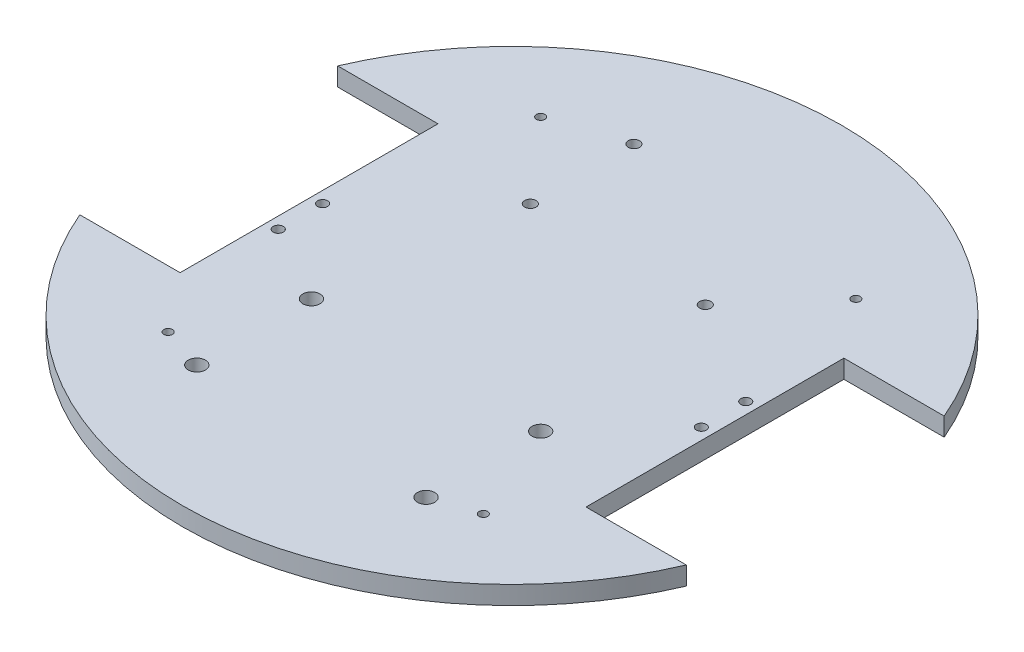
ISO-10303-21;
HEADER;
FILE_DESCRIPTION(('STEP AP214'),'2;1');
FILE_NAME('part.step','',(''),(''),'','','');
FILE_SCHEMA(('AUTOMOTIVE_DESIGN { 1 0 10303 214 1 1 1 1 }'));
ENDSEC;
DATA;
#1=APPLICATION_CONTEXT('core data for automotive mechanical design processes');
#2=APPLICATION_PROTOCOL_DEFINITION('international standard','automotive_design',2000,#1);
#3=PRODUCT_CONTEXT('',#1,'mechanical');
#4=PRODUCT('Part','Part','',(#3));
#5=PRODUCT_RELATED_PRODUCT_CATEGORY('part','',(#4));
#6=PRODUCT_DEFINITION_FORMATION('','',#4);
#7=PRODUCT_DEFINITION_CONTEXT('part definition',#1,'design');
#8=PRODUCT_DEFINITION('design','',#6,#7);
#9=PRODUCT_DEFINITION_SHAPE('','',#8);
#10=(LENGTH_UNIT() NAMED_UNIT(*) SI_UNIT(.MILLI.,.METRE.));
#11=(NAMED_UNIT(*) PLANE_ANGLE_UNIT() SI_UNIT($,.RADIAN.));
#12=(NAMED_UNIT(*) SI_UNIT($,.STERADIAN.) SOLID_ANGLE_UNIT());
#13=UNCERTAINTY_MEASURE_WITH_UNIT(LENGTH_MEASURE(1.E-05),#10,'distance_accuracy_value','');
#14=(GEOMETRIC_REPRESENTATION_CONTEXT(3) GLOBAL_UNCERTAINTY_ASSIGNED_CONTEXT((#13)) GLOBAL_UNIT_ASSIGNED_CONTEXT((#10,
#11,#12)) REPRESENTATION_CONTEXT('',''));
#15=CARTESIAN_POINT('',(0.,0.,0.));
#16=DIRECTION('',(0.,0.,1.));
#17=DIRECTION('',(1.,0.,0.));
#18=AXIS2_PLACEMENT_3D('',#15,#16,#17);
#19=CARTESIAN_POINT('',(0.,6.4,0.));
#20=DIRECTION('',(0.,-1.,0.));
#21=DIRECTION('',(0.,0.,-1.));
#22=AXIS2_PLACEMENT_3D('',#19,#20,#21);
#23=CYLINDRICAL_SURFACE('',#22,115.);
#24=DIRECTION('',(0.,1.,0.));
#25=VECTOR('',#24,1.);
#26=CARTESIAN_POINT('',(105.830052442584,-1.1,45.));
#27=LINE('',#26,#25);
#28=CARTESIAN_POINT('',(105.830052442584,0.,45.));
#29=VERTEX_POINT('',#28);
#30=CARTESIAN_POINT('',(105.830052442584,6.4,45.));
#31=VERTEX_POINT('',#30);
#32=EDGE_CURVE('E106',#29,#31,#27,.T.);
#33=ORIENTED_EDGE('',*,*,#32,.T.);
#34=CARTESIAN_POINT('',(0.,6.4,0.));
#35=DIRECTION('',(0.,1.,0.));
#36=DIRECTION('',(0.,0.,1.));
#37=AXIS2_PLACEMENT_3D('',#34,#35,#36);
#38=CIRCLE('',#37,115.);
#39=CARTESIAN_POINT('',(-105.830052442584,6.4,45.));
#40=VERTEX_POINT('',#39);
#41=EDGE_CURVE('E121',#40,#31,#38,.T.);
#42=ORIENTED_EDGE('',*,*,#41,.F.);
#43=DIRECTION('',(0.,1.,0.));
#44=VECTOR('',#43,1.);
#45=CARTESIAN_POINT('',(-105.830052442584,-1.1,45.));
#46=LINE('',#45,#44);
#47=CARTESIAN_POINT('',(-105.830052442584,0.,45.));
#48=VERTEX_POINT('',#47);
#49=EDGE_CURVE('E167',#48,#40,#46,.T.);
#50=ORIENTED_EDGE('',*,*,#49,.F.);
#51=CARTESIAN_POINT('',(0.,0.,0.));
#52=DIRECTION('',(0.,1.,0.));
#53=DIRECTION('',(0.,0.,1.));
#54=AXIS2_PLACEMENT_3D('',#51,#52,#53);
#55=CIRCLE('',#54,115.);
#56=EDGE_CURVE('E122',#48,#29,#55,.T.);
#57=ORIENTED_EDGE('',*,*,#56,.T.);
#58=EDGE_LOOP('',(#33,#42,#50,#57));
#59=FACE_BOUND('',#58,.T.);
#60=ADVANCED_FACE('F32',(#59),#23,.T.);
#61=CARTESIAN_POINT('',(105.830052442584,6.4,-45.0000000000001));
#62=VERTEX_POINT('',#61);
#63=CARTESIAN_POINT('',(-105.830052442584,6.4,-45.));
#64=VERTEX_POINT('',#63);
#65=EDGE_CURVE('E112',#62,#64,#38,.T.);
#66=ORIENTED_EDGE('',*,*,#65,.F.);
#67=DIRECTION('',(0.,1.,0.));
#68=VECTOR('',#67,1.);
#69=CARTESIAN_POINT('',(105.830052442584,-1.1,-45.0000000000001));
#70=LINE('',#69,#68);
#71=CARTESIAN_POINT('',(105.830052442584,0.,-45.0000000000001));
#72=VERTEX_POINT('',#71);
#73=EDGE_CURVE('E97',#72,#62,#70,.T.);
#74=ORIENTED_EDGE('',*,*,#73,.F.);
#75=CARTESIAN_POINT('',(-105.830052442584,0.,-45.));
#76=VERTEX_POINT('',#75);
#77=EDGE_CURVE('E127',#72,#76,#55,.T.);
#78=ORIENTED_EDGE('',*,*,#77,.T.);
#79=DIRECTION('',(0.,1.,0.));
#80=VECTOR('',#79,1.);
#81=CARTESIAN_POINT('',(-105.830052442584,-1.1,-45.));
#82=LINE('',#81,#80);
#83=EDGE_CURVE('E120',#76,#64,#82,.T.);
#84=ORIENTED_EDGE('',*,*,#83,.T.);
#85=EDGE_LOOP('',(#66,#74,#78,#84));
#86=FACE_BOUND('',#85,.T.);
#87=ADVANCED_FACE('F34',(#86),#23,.T.);
#88=CARTESIAN_POINT('',(0.,6.4,0.));
#89=DIRECTION('',(0.,1.,0.));
#90=DIRECTION('',(0.,0.,1.));
#91=AXIS2_PLACEMENT_3D('',#88,#89,#90);
#92=PLANE('',#91);
#93=CARTESIAN_POINT('',(55.,6.4,-65.));
#94=DIRECTION('',(0.,-1.,0.));
#95=DIRECTION('',(0.,0.,-1.));
#96=AXIS2_PLACEMENT_3D('',#93,#94,#95);
#97=CIRCLE('',#96,1.49999999999999);
#98=CARTESIAN_POINT('',(55.,6.4,-66.5));
#99=VERTEX_POINT('',#98);
#100=EDGE_CURVE('E405',#99,#99,#97,.T.);
#101=ORIENTED_EDGE('',*,*,#100,.T.);
#102=EDGE_LOOP('',(#101));
#103=FACE_BOUND('',#102,.T.);
#104=CARTESIAN_POINT('',(-55.,6.4,-65.));
#105=DIRECTION('',(0.,-1.,0.));
#106=DIRECTION('',(0.,0.,-1.));
#107=AXIS2_PLACEMENT_3D('',#104,#105,#106);
#108=CIRCLE('',#107,1.49999999999999);
#109=CARTESIAN_POINT('',(-55.,6.4,-66.5));
#110=VERTEX_POINT('',#109);
#111=EDGE_CURVE('E415',#110,#110,#108,.T.);
#112=ORIENTED_EDGE('',*,*,#111,.T.);
#113=EDGE_LOOP('',(#112));
#114=FACE_BOUND('',#113,.T.);
#115=CARTESIAN_POINT('',(-55.,6.4,65.));
#116=DIRECTION('',(0.,-1.,0.));
#117=DIRECTION('',(0.,0.,-1.));
#118=AXIS2_PLACEMENT_3D('',#115,#116,#117);
#119=CIRCLE('',#118,1.49999999999999);
#120=CARTESIAN_POINT('',(-55.,6.4,63.5));
#121=VERTEX_POINT('',#120);
#122=EDGE_CURVE('E421',#121,#121,#119,.T.);
#123=ORIENTED_EDGE('',*,*,#122,.T.);
#124=EDGE_LOOP('',(#123));
#125=FACE_BOUND('',#124,.T.);
#126=CARTESIAN_POINT('',(55.,6.4,65.));
#127=DIRECTION('',(0.,-1.,0.));
#128=DIRECTION('',(0.,0.,-1.));
#129=AXIS2_PLACEMENT_3D('',#126,#127,#128);
#130=CIRCLE('',#129,1.49999999999999);
#131=CARTESIAN_POINT('',(55.,6.4,63.5));
#132=VERTEX_POINT('',#131);
#133=EDGE_CURVE('E427',#132,#132,#130,.T.);
#134=ORIENTED_EDGE('',*,*,#133,.T.);
#135=EDGE_LOOP('',(#134));
#136=FACE_BOUND('',#135,.T.);
#137=CARTESIAN_POINT('',(-40.,6.4,69.9999999999988));
#138=DIRECTION('',(0.,1.,0.));
#139=DIRECTION('',(0.,0.,-1.));
#140=AXIS2_PLACEMENT_3D('',#137,#138,#139);
#141=CIRCLE('',#140,3.);
#142=CARTESIAN_POINT('',(-40.,6.4,66.9999999999988));
#143=VERTEX_POINT('',#142);
#144=EDGE_CURVE('E430',#143,#143,#141,.T.);
#145=ORIENTED_EDGE('',*,*,#144,.F.);
#146=EDGE_LOOP('',(#145));
#147=FACE_BOUND('',#146,.T.);
#148=CARTESIAN_POINT('',(40.,6.4,69.9999999999988));
#149=DIRECTION('',(0.,1.,0.));
#150=DIRECTION('',(0.,0.,1.));
#151=AXIS2_PLACEMENT_3D('',#148,#149,#150);
#152=CIRCLE('',#151,3.);
#153=CARTESIAN_POINT('',(40.,6.4,72.9999999999988));
#154=VERTEX_POINT('',#153);
#155=EDGE_CURVE('E434',#154,#154,#152,.T.);
#156=ORIENTED_EDGE('',*,*,#155,.F.);
#157=EDGE_LOOP('',(#156));
#158=FACE_BOUND('',#157,.T.);
#159=CARTESIAN_POINT('',(40.,6.4,30.0000000000011));
#160=DIRECTION('',(0.,1.,0.));
#161=DIRECTION('',(0.,0.,-1.));
#162=AXIS2_PLACEMENT_3D('',#159,#160,#161);
#163=CIRCLE('',#162,3.);
#164=CARTESIAN_POINT('',(40.,6.4,27.0000000000011));
#165=VERTEX_POINT('',#164);
#166=EDGE_CURVE('E440',#165,#165,#163,.T.);
#167=ORIENTED_EDGE('',*,*,#166,.F.);
#168=EDGE_LOOP('',(#167));
#169=FACE_BOUND('',#168,.T.);
#170=CARTESIAN_POINT('',(-40.,6.4,30.0000000000011));
#171=DIRECTION('',(0.,1.,0.));
#172=DIRECTION('',(0.,0.,1.));
#173=AXIS2_PLACEMENT_3D('',#170,#171,#172);
#174=CIRCLE('',#173,3.);
#175=CARTESIAN_POINT('',(-40.,6.4,33.0000000000011));
#176=VERTEX_POINT('',#175);
#177=EDGE_CURVE('E446',#176,#176,#174,.T.);
#178=ORIENTED_EDGE('',*,*,#177,.F.);
#179=EDGE_LOOP('',(#178));
#180=FACE_BOUND('',#179,.T.);
#181=CARTESIAN_POINT('',(-30.525,6.4,-73.07));
#182=DIRECTION('',(0.,1.,0.));
#183=DIRECTION('',(0.,0.,1.));
#184=AXIS2_PLACEMENT_3D('',#181,#182,#183);
#185=CIRCLE('',#184,2.);
#186=CARTESIAN_POINT('',(-30.525,6.4,-71.07));
#187=VERTEX_POINT('',#186);
#188=EDGE_CURVE('E452',#187,#187,#185,.T.);
#189=ORIENTED_EDGE('',*,*,#188,.F.);
#190=EDGE_LOOP('',(#189));
#191=FACE_BOUND('',#190,.T.);
#192=CARTESIAN_POINT('',(-30.525,6.4,-36.93));
#193=DIRECTION('',(0.,1.,0.));
#194=DIRECTION('',(0.,0.,-1.));
#195=AXIS2_PLACEMENT_3D('',#192,#193,#194);
#196=CIRCLE('',#195,2.);
#197=CARTESIAN_POINT('',(-30.525,6.4,-38.93));
#198=VERTEX_POINT('',#197);
#199=EDGE_CURVE('E458',#198,#198,#196,.T.);
#200=ORIENTED_EDGE('',*,*,#199,.F.);
#201=EDGE_LOOP('',(#200));
#202=FACE_BOUND('',#201,.T.);
#203=CARTESIAN_POINT('',(30.525,6.4,-36.93));
#204=DIRECTION('',(0.,1.,0.));
#205=DIRECTION('',(0.,0.,1.));
#206=AXIS2_PLACEMENT_3D('',#203,#204,#205);
#207=CIRCLE('',#206,2.);
#208=CARTESIAN_POINT('',(30.525,6.4,-34.93));
#209=VERTEX_POINT('',#208);
#210=EDGE_CURVE('E464',#209,#209,#207,.T.);
#211=ORIENTED_EDGE('',*,*,#210,.F.);
#212=EDGE_LOOP('',(#211));
#213=FACE_BOUND('',#212,.T.);
#214=CARTESIAN_POINT('',(66.8300524425836,6.4,-14.75));
#215=DIRECTION('',(0.,1.,0.));
#216=DIRECTION('',(0.,0.,-1.));
#217=AXIS2_PLACEMENT_3D('',#214,#215,#216);
#218=CIRCLE('',#217,1.75);
#219=CARTESIAN_POINT('',(66.8300524425836,6.4,-16.5));
#220=VERTEX_POINT('',#219);
#221=EDGE_CURVE('E470',#220,#220,#218,.T.);
#222=ORIENTED_EDGE('',*,*,#221,.F.);
#223=EDGE_LOOP('',(#222));
#224=FACE_BOUND('',#223,.T.);
#225=CARTESIAN_POINT('',(66.8300524425836,6.4,0.749999999999992));
#226=DIRECTION('',(0.,1.,0.));
#227=DIRECTION('',(0.,0.,1.));
#228=AXIS2_PLACEMENT_3D('',#225,#226,#227);
#229=CIRCLE('',#228,1.75);
#230=CARTESIAN_POINT('',(66.8300524425836,6.4,2.49999999999999));
#231=VERTEX_POINT('',#230);
#232=EDGE_CURVE('E476',#231,#231,#229,.T.);
#233=ORIENTED_EDGE('',*,*,#232,.F.);
#234=EDGE_LOOP('',(#233));
#235=FACE_BOUND('',#234,.T.);
#236=CARTESIAN_POINT('',(-66.8300524425836,6.4,14.75));
#237=DIRECTION('',(0.,1.,0.));
#238=DIRECTION('',(0.,0.,-1.));
#239=AXIS2_PLACEMENT_3D('',#236,#237,#238);
#240=CIRCLE('',#239,1.75);
#241=CARTESIAN_POINT('',(-66.8300524425836,6.4,13.));
#242=VERTEX_POINT('',#241);
#243=EDGE_CURVE('E482',#242,#242,#240,.T.);
#244=ORIENTED_EDGE('',*,*,#243,.F.);
#245=EDGE_LOOP('',(#244));
#246=FACE_BOUND('',#245,.T.);
#247=CARTESIAN_POINT('',(-66.8300524425836,6.4,-0.749999999999992));
#248=DIRECTION('',(0.,1.,0.));
#249=DIRECTION('',(0.,0.,1.));
#250=AXIS2_PLACEMENT_3D('',#247,#248,#249);
#251=CIRCLE('',#250,1.75);
#252=CARTESIAN_POINT('',(-66.8300524425836,6.4,1.00000000000001));
#253=VERTEX_POINT('',#252);
#254=EDGE_CURVE('E155',#253,#253,#251,.T.);
#255=ORIENTED_EDGE('',*,*,#254,.F.);
#256=EDGE_LOOP('',(#255));
#257=FACE_BOUND('',#256,.T.);
#258=DIRECTION('',(-1.,0.,0.));
#259=VECTOR('',#258,1.);
#260=CARTESIAN_POINT('',(105.830052442584,6.4,-45.0000000000001));
#261=LINE('',#260,#259);
#262=CARTESIAN_POINT('',(70.8300524425836,6.4,-45.));
#263=VERTEX_POINT('',#262);
#264=EDGE_CURVE('E101',#62,#263,#261,.T.);
#265=ORIENTED_EDGE('',*,*,#264,.F.);
#266=ORIENTED_EDGE('',*,*,#65,.T.);
#267=DIRECTION('',(1.,0.,0.));
#268=VECTOR('',#267,1.);
#269=CARTESIAN_POINT('',(-105.830052442584,6.4,-45.));
#270=LINE('',#269,#268);
#271=CARTESIAN_POINT('',(-70.8300524425836,6.4,-45.));
#272=VERTEX_POINT('',#271);
#273=EDGE_CURVE('E116',#64,#272,#270,.T.);
#274=ORIENTED_EDGE('',*,*,#273,.T.);
#275=DIRECTION('',(0.,0.,1.));
#276=VECTOR('',#275,1.);
#277=CARTESIAN_POINT('',(-70.8300524425836,6.4,-45.));
#278=LINE('',#277,#276);
#279=CARTESIAN_POINT('',(-70.8300524425836,6.4,45.));
#280=VERTEX_POINT('',#279);
#281=EDGE_CURVE('E161',#272,#280,#278,.T.);
#282=ORIENTED_EDGE('',*,*,#281,.T.);
#283=DIRECTION('',(1.,0.,0.));
#284=VECTOR('',#283,1.);
#285=CARTESIAN_POINT('',(-105.830052442584,6.4,45.));
#286=LINE('',#285,#284);
#287=EDGE_CURVE('E164',#40,#280,#286,.T.);
#288=ORIENTED_EDGE('',*,*,#287,.F.);
#289=ORIENTED_EDGE('',*,*,#41,.T.);
#290=DIRECTION('',(-1.,0.,0.));
#291=VECTOR('',#290,1.);
#292=CARTESIAN_POINT('',(105.830052442584,6.4,45.));
#293=LINE('',#292,#291);
#294=CARTESIAN_POINT('',(70.8300524425836,6.4,45.));
#295=VERTEX_POINT('',#294);
#296=EDGE_CURVE('E150',#31,#295,#293,.T.);
#297=ORIENTED_EDGE('',*,*,#296,.T.);
#298=DIRECTION('',(0.,0.,1.));
#299=VECTOR('',#298,1.);
#300=CARTESIAN_POINT('',(70.8300524425836,6.4,-45.));
#301=LINE('',#300,#299);
#302=EDGE_CURVE('E115',#263,#295,#301,.T.);
#303=ORIENTED_EDGE('',*,*,#302,.F.);
#304=EDGE_LOOP('',(#265,#266,#274,#282,#288,#289,#297,#303));
#305=FACE_BOUND('',#304,.T.);
#306=ADVANCED_FACE('F110',(#103,#114,#125,#136,#147,#158,#169,#180,#191,#202,#213,#224,#235,
#246,#257,#305),#92,.T.);
#307=CARTESIAN_POINT('',(0.,0.,0.));
#308=DIRECTION('',(0.,1.,0.));
#309=DIRECTION('',(0.,0.,1.));
#310=AXIS2_PLACEMENT_3D('',#307,#308,#309);
#311=PLANE('',#310);
#312=CARTESIAN_POINT('',(55.,0.,-65.));
#313=DIRECTION('',(0.,-1.,0.));
#314=DIRECTION('',(0.,0.,-1.));
#315=AXIS2_PLACEMENT_3D('',#312,#313,#314);
#316=CIRCLE('',#315,1.5);
#317=CARTESIAN_POINT('',(55.,0.,-66.5));
#318=VERTEX_POINT('',#317);
#319=EDGE_CURVE('E408',#318,#318,#316,.T.);
#320=ORIENTED_EDGE('',*,*,#319,.F.);
#321=EDGE_LOOP('',(#320));
#322=FACE_BOUND('',#321,.T.);
#323=CARTESIAN_POINT('',(-55.,0.,-65.));
#324=DIRECTION('',(0.,-1.,0.));
#325=DIRECTION('',(0.,0.,-1.));
#326=AXIS2_PLACEMENT_3D('',#323,#324,#325);
#327=CIRCLE('',#326,1.5);
#328=CARTESIAN_POINT('',(-55.,0.,-66.5));
#329=VERTEX_POINT('',#328);
#330=EDGE_CURVE('E410',#329,#329,#327,.T.);
#331=ORIENTED_EDGE('',*,*,#330,.F.);
#332=EDGE_LOOP('',(#331));
#333=FACE_BOUND('',#332,.T.);
#334=CARTESIAN_POINT('',(-55.,0.,65.));
#335=DIRECTION('',(0.,-1.,0.));
#336=DIRECTION('',(0.,0.,-1.));
#337=AXIS2_PLACEMENT_3D('',#334,#335,#336);
#338=CIRCLE('',#337,1.5);
#339=CARTESIAN_POINT('',(-55.,0.,63.5));
#340=VERTEX_POINT('',#339);
#341=EDGE_CURVE('E418',#340,#340,#338,.T.);
#342=ORIENTED_EDGE('',*,*,#341,.F.);
#343=EDGE_LOOP('',(#342));
#344=FACE_BOUND('',#343,.T.);
#345=CARTESIAN_POINT('',(55.,0.,65.));
#346=DIRECTION('',(0.,-1.,0.));
#347=DIRECTION('',(0.,0.,-1.));
#348=AXIS2_PLACEMENT_3D('',#345,#346,#347);
#349=CIRCLE('',#348,1.5);
#350=CARTESIAN_POINT('',(55.,0.,63.5));
#351=VERTEX_POINT('',#350);
#352=EDGE_CURVE('E424',#351,#351,#349,.T.);
#353=ORIENTED_EDGE('',*,*,#352,.F.);
#354=EDGE_LOOP('',(#353));
#355=FACE_BOUND('',#354,.T.);
#356=CARTESIAN_POINT('',(-40.,0.,69.9999999999988));
#357=DIRECTION('',(0.,1.,0.));
#358=DIRECTION('',(0.,0.,-1.));
#359=AXIS2_PLACEMENT_3D('',#356,#357,#358);
#360=CIRCLE('',#359,3.);
#361=CARTESIAN_POINT('',(-40.,0.,66.9999999999988));
#362=VERTEX_POINT('',#361);
#363=EDGE_CURVE('E431',#362,#362,#360,.T.);
#364=ORIENTED_EDGE('',*,*,#363,.T.);
#365=EDGE_LOOP('',(#364));
#366=FACE_BOUND('',#365,.T.);
#367=CARTESIAN_POINT('',(40.,0.,69.9999999999988));
#368=DIRECTION('',(0.,1.,0.));
#369=DIRECTION('',(0.,0.,1.));
#370=AXIS2_PLACEMENT_3D('',#367,#368,#369);
#371=CIRCLE('',#370,3.);
#372=CARTESIAN_POINT('',(40.,0.,72.9999999999988));
#373=VERTEX_POINT('',#372);
#374=EDGE_CURVE('E437',#373,#373,#371,.T.);
#375=ORIENTED_EDGE('',*,*,#374,.T.);
#376=EDGE_LOOP('',(#375));
#377=FACE_BOUND('',#376,.T.);
#378=CARTESIAN_POINT('',(40.,0.,30.0000000000011));
#379=DIRECTION('',(0.,1.,0.));
#380=DIRECTION('',(0.,0.,-1.));
#381=AXIS2_PLACEMENT_3D('',#378,#379,#380);
#382=CIRCLE('',#381,3.);
#383=CARTESIAN_POINT('',(40.,0.,27.0000000000011));
#384=VERTEX_POINT('',#383);
#385=EDGE_CURVE('E443',#384,#384,#382,.T.);
#386=ORIENTED_EDGE('',*,*,#385,.T.);
#387=EDGE_LOOP('',(#386));
#388=FACE_BOUND('',#387,.T.);
#389=CARTESIAN_POINT('',(-40.,0.,30.0000000000011));
#390=DIRECTION('',(0.,1.,0.));
#391=DIRECTION('',(0.,0.,1.));
#392=AXIS2_PLACEMENT_3D('',#389,#390,#391);
#393=CIRCLE('',#392,3.);
#394=CARTESIAN_POINT('',(-40.,0.,33.0000000000011));
#395=VERTEX_POINT('',#394);
#396=EDGE_CURVE('E449',#395,#395,#393,.T.);
#397=ORIENTED_EDGE('',*,*,#396,.T.);
#398=EDGE_LOOP('',(#397));
#399=FACE_BOUND('',#398,.T.);
#400=CARTESIAN_POINT('',(-30.525,0.,-73.07));
#401=DIRECTION('',(0.,1.,0.));
#402=DIRECTION('',(0.,0.,1.));
#403=AXIS2_PLACEMENT_3D('',#400,#401,#402);
#404=CIRCLE('',#403,2.);
#405=CARTESIAN_POINT('',(-30.525,0.,-71.07));
#406=VERTEX_POINT('',#405);
#407=EDGE_CURVE('E455',#406,#406,#404,.T.);
#408=ORIENTED_EDGE('',*,*,#407,.T.);
#409=EDGE_LOOP('',(#408));
#410=FACE_BOUND('',#409,.T.);
#411=CARTESIAN_POINT('',(-30.525,0.,-36.93));
#412=DIRECTION('',(0.,1.,0.));
#413=DIRECTION('',(0.,0.,-1.));
#414=AXIS2_PLACEMENT_3D('',#411,#412,#413);
#415=CIRCLE('',#414,2.);
#416=CARTESIAN_POINT('',(-30.525,0.,-38.93));
#417=VERTEX_POINT('',#416);
#418=EDGE_CURVE('E461',#417,#417,#415,.T.);
#419=ORIENTED_EDGE('',*,*,#418,.T.);
#420=EDGE_LOOP('',(#419));
#421=FACE_BOUND('',#420,.T.);
#422=CARTESIAN_POINT('',(30.525,0.,-36.93));
#423=DIRECTION('',(0.,1.,0.));
#424=DIRECTION('',(0.,0.,1.));
#425=AXIS2_PLACEMENT_3D('',#422,#423,#424);
#426=CIRCLE('',#425,2.);
#427=CARTESIAN_POINT('',(30.525,0.,-34.93));
#428=VERTEX_POINT('',#427);
#429=EDGE_CURVE('E467',#428,#428,#426,.T.);
#430=ORIENTED_EDGE('',*,*,#429,.T.);
#431=EDGE_LOOP('',(#430));
#432=FACE_BOUND('',#431,.T.);
#433=CARTESIAN_POINT('',(66.8300524425836,0.,-14.75));
#434=DIRECTION('',(0.,1.,0.));
#435=DIRECTION('',(0.,0.,-1.));
#436=AXIS2_PLACEMENT_3D('',#433,#434,#435);
#437=CIRCLE('',#436,1.75);
#438=CARTESIAN_POINT('',(66.8300524425836,0.,-16.5));
#439=VERTEX_POINT('',#438);
#440=EDGE_CURVE('E473',#439,#439,#437,.T.);
#441=ORIENTED_EDGE('',*,*,#440,.T.);
#442=EDGE_LOOP('',(#441));
#443=FACE_BOUND('',#442,.T.);
#444=CARTESIAN_POINT('',(66.8300524425836,0.,0.749999999999992));
#445=DIRECTION('',(0.,1.,0.));
#446=DIRECTION('',(0.,0.,1.));
#447=AXIS2_PLACEMENT_3D('',#444,#445,#446);
#448=CIRCLE('',#447,1.75);
#449=CARTESIAN_POINT('',(66.8300524425836,0.,2.49999999999999));
#450=VERTEX_POINT('',#449);
#451=EDGE_CURVE('E479',#450,#450,#448,.T.);
#452=ORIENTED_EDGE('',*,*,#451,.T.);
#453=EDGE_LOOP('',(#452));
#454=FACE_BOUND('',#453,.T.);
#455=CARTESIAN_POINT('',(-66.8300524425836,0.,14.75));
#456=DIRECTION('',(0.,1.,0.));
#457=DIRECTION('',(0.,0.,-1.));
#458=AXIS2_PLACEMENT_3D('',#455,#456,#457);
#459=CIRCLE('',#458,1.75);
#460=CARTESIAN_POINT('',(-66.8300524425836,0.,13.));
#461=VERTEX_POINT('',#460);
#462=EDGE_CURVE('E485',#461,#461,#459,.T.);
#463=ORIENTED_EDGE('',*,*,#462,.T.);
#464=EDGE_LOOP('',(#463));
#465=FACE_BOUND('',#464,.T.);
#466=CARTESIAN_POINT('',(-66.8300524425836,0.,-0.749999999999992));
#467=DIRECTION('',(0.,1.,0.));
#468=DIRECTION('',(0.,0.,1.));
#469=AXIS2_PLACEMENT_3D('',#466,#467,#468);
#470=CIRCLE('',#469,1.75);
#471=CARTESIAN_POINT('',(-66.8300524425836,0.,1.00000000000001));
#472=VERTEX_POINT('',#471);
#473=EDGE_CURVE('E107',#472,#472,#470,.T.);
#474=ORIENTED_EDGE('',*,*,#473,.T.);
#475=EDGE_LOOP('',(#474));
#476=FACE_BOUND('',#475,.T.);
#477=ORIENTED_EDGE('',*,*,#77,.F.);
#478=DIRECTION('',(-1.,0.,0.));
#479=VECTOR('',#478,1.);
#480=CARTESIAN_POINT('',(0.,0.,-45.));
#481=LINE('',#480,#479);
#482=CARTESIAN_POINT('',(70.8300524425836,0.,-45.));
#483=VERTEX_POINT('',#482);
#484=EDGE_CURVE('E11',#72,#483,#481,.T.);
#485=ORIENTED_EDGE('',*,*,#484,.T.);
#486=DIRECTION('',(0.,0.,1.));
#487=VECTOR('',#486,1.);
#488=CARTESIAN_POINT('',(70.8300524425836,0.,0.));
#489=LINE('',#488,#487);
#490=CARTESIAN_POINT('',(70.8300524425836,0.,45.));
#491=VERTEX_POINT('',#490);
#492=EDGE_CURVE('E139',#483,#491,#489,.T.);
#493=ORIENTED_EDGE('',*,*,#492,.T.);
#494=DIRECTION('',(-1.,0.,0.));
#495=VECTOR('',#494,1.);
#496=CARTESIAN_POINT('',(0.,0.,45.));
#497=LINE('',#496,#495);
#498=EDGE_CURVE('E40',#29,#491,#497,.T.);
#499=ORIENTED_EDGE('',*,*,#498,.F.);
#500=ORIENTED_EDGE('',*,*,#56,.F.);
#501=DIRECTION('',(1.,0.,0.));
#502=VECTOR('',#501,1.);
#503=CARTESIAN_POINT('',(0.,0.,45.));
#504=LINE('',#503,#502);
#505=CARTESIAN_POINT('',(-70.8300524425836,0.,45.));
#506=VERTEX_POINT('',#505);
#507=EDGE_CURVE('E125',#48,#506,#504,.T.);
#508=ORIENTED_EDGE('',*,*,#507,.T.);
#509=DIRECTION('',(0.,0.,1.));
#510=VECTOR('',#509,1.);
#511=CARTESIAN_POINT('',(-70.8300524425836,0.,0.));
#512=LINE('',#511,#510);
#513=CARTESIAN_POINT('',(-70.8300524425836,0.,-45.));
#514=VERTEX_POINT('',#513);
#515=EDGE_CURVE('E135',#514,#506,#512,.T.);
#516=ORIENTED_EDGE('',*,*,#515,.F.);
#517=DIRECTION('',(1.,0.,0.));
#518=VECTOR('',#517,1.);
#519=CARTESIAN_POINT('',(0.,0.,-45.));
#520=LINE('',#519,#518);
#521=EDGE_CURVE('E137',#76,#514,#520,.T.);
#522=ORIENTED_EDGE('',*,*,#521,.F.);
#523=EDGE_LOOP('',(#477,#485,#493,#499,#500,#508,#516,#522));
#524=FACE_BOUND('',#523,.T.);
#525=ADVANCED_FACE('F147',(#322,#333,#344,#355,#366,#377,#388,#399,#410,#421,#432,#443,#454,
#465,#476,#524),#311,.F.);
#526=CARTESIAN_POINT('',(-105.830052442584,-1.1,-45.));
#527=DIRECTION('',(0.,0.,1.));
#528=DIRECTION('',(1.,0.,0.));
#529=AXIS2_PLACEMENT_3D('',#526,#527,#528);
#530=PLANE('',#529);
#531=ORIENTED_EDGE('',*,*,#521,.T.);
#532=DIRECTION('',(0.,1.,0.));
#533=VECTOR('',#532,1.);
#534=CARTESIAN_POINT('',(-70.8300524425836,-1.1,-45.));
#535=LINE('',#534,#533);
#536=EDGE_CURVE('E130',#514,#272,#535,.T.);
#537=ORIENTED_EDGE('',*,*,#536,.T.);
#538=ORIENTED_EDGE('',*,*,#273,.F.);
#539=ORIENTED_EDGE('',*,*,#83,.F.);
#540=EDGE_LOOP('',(#531,#537,#538,#539));
#541=FACE_BOUND('',#540,.T.);
#542=ADVANCED_FACE('F173',(#541),#530,.T.);
#543=CARTESIAN_POINT('',(-70.8300524425836,-1.1,-45.));
#544=DIRECTION('',(-1.,0.,0.));
#545=DIRECTION('',(0.,0.,1.));
#546=AXIS2_PLACEMENT_3D('',#543,#544,#545);
#547=PLANE('',#546);
#548=ORIENTED_EDGE('',*,*,#515,.T.);
#549=DIRECTION('',(0.,1.,0.));
#550=VECTOR('',#549,1.);
#551=CARTESIAN_POINT('',(-70.8300524425836,-1.1,45.));
#552=LINE('',#551,#550);
#553=EDGE_CURVE('E55',#506,#280,#552,.T.);
#554=ORIENTED_EDGE('',*,*,#553,.T.);
#555=ORIENTED_EDGE('',*,*,#281,.F.);
#556=ORIENTED_EDGE('',*,*,#536,.F.);
#557=EDGE_LOOP('',(#548,#554,#555,#556));
#558=FACE_BOUND('',#557,.T.);
#559=ADVANCED_FACE('F175',(#558),#547,.T.);
#560=CARTESIAN_POINT('',(-105.830052442584,-1.1,45.));
#561=DIRECTION('',(0.,0.,1.));
#562=DIRECTION('',(1.,0.,0.));
#563=AXIS2_PLACEMENT_3D('',#560,#561,#562);
#564=PLANE('',#563);
#565=ORIENTED_EDGE('',*,*,#49,.T.);
#566=ORIENTED_EDGE('',*,*,#287,.T.);
#567=ORIENTED_EDGE('',*,*,#553,.F.);
#568=ORIENTED_EDGE('',*,*,#507,.F.);
#569=EDGE_LOOP('',(#565,#566,#567,#568));
#570=FACE_BOUND('',#569,.T.);
#571=ADVANCED_FACE('F180',(#570),#564,.F.);
#572=CARTESIAN_POINT('',(105.830052442584,-1.1,-45.0000000000001));
#573=DIRECTION('',(0.,0.,-1.));
#574=DIRECTION('',(-1.,0.,0.));
#575=AXIS2_PLACEMENT_3D('',#572,#573,#574);
#576=PLANE('',#575);
#577=ORIENTED_EDGE('',*,*,#73,.T.);
#578=ORIENTED_EDGE('',*,*,#264,.T.);
#579=DIRECTION('',(0.,1.,0.));
#580=VECTOR('',#579,1.);
#581=CARTESIAN_POINT('',(70.8300524425836,-1.1,-45.));
#582=LINE('',#581,#580);
#583=EDGE_CURVE('E149',#483,#263,#582,.T.);
#584=ORIENTED_EDGE('',*,*,#583,.F.);
#585=ORIENTED_EDGE('',*,*,#484,.F.);
#586=EDGE_LOOP('',(#577,#578,#584,#585));
#587=FACE_BOUND('',#586,.T.);
#588=ADVANCED_FACE('F99',(#587),#576,.F.);
#589=CARTESIAN_POINT('',(105.830052442584,-1.1,45.));
#590=DIRECTION('',(0.,0.,-1.));
#591=DIRECTION('',(-1.,0.,0.));
#592=AXIS2_PLACEMENT_3D('',#589,#590,#591);
#593=PLANE('',#592);
#594=ORIENTED_EDGE('',*,*,#498,.T.);
#595=DIRECTION('',(0.,1.,0.));
#596=VECTOR('',#595,1.);
#597=CARTESIAN_POINT('',(70.8300524425836,-1.1,45.));
#598=LINE('',#597,#596);
#599=EDGE_CURVE('E47',#491,#295,#598,.T.);
#600=ORIENTED_EDGE('',*,*,#599,.T.);
#601=ORIENTED_EDGE('',*,*,#296,.F.);
#602=ORIENTED_EDGE('',*,*,#32,.F.);
#603=EDGE_LOOP('',(#594,#600,#601,#602));
#604=FACE_BOUND('',#603,.T.);
#605=ADVANCED_FACE('F143',(#604),#593,.T.);
#606=CARTESIAN_POINT('',(70.8300524425836,-1.1,-45.));
#607=DIRECTION('',(-1.,0.,0.));
#608=DIRECTION('',(0.,0.,1.));
#609=AXIS2_PLACEMENT_3D('',#606,#607,#608);
#610=PLANE('',#609);
#611=ORIENTED_EDGE('',*,*,#583,.T.);
#612=ORIENTED_EDGE('',*,*,#302,.T.);
#613=ORIENTED_EDGE('',*,*,#599,.F.);
#614=ORIENTED_EDGE('',*,*,#492,.F.);
#615=EDGE_LOOP('',(#611,#612,#613,#614));
#616=FACE_BOUND('',#615,.T.);
#617=ADVANCED_FACE('F148',(#616),#610,.F.);
#618=CARTESIAN_POINT('',(-66.8300524425836,0.,-0.749999999999992));
#619=DIRECTION('',(0.,1.,0.));
#620=DIRECTION('',(0.,0.,1.));
#621=AXIS2_PLACEMENT_3D('',#618,#619,#620);
#622=CYLINDRICAL_SURFACE('',#621,1.75);
#623=ORIENTED_EDGE('',*,*,#473,.F.);
#624=EDGE_LOOP('',(#623));
#625=FACE_BOUND('',#624,.T.);
#626=ORIENTED_EDGE('',*,*,#254,.T.);
#627=EDGE_LOOP('',(#626));
#628=FACE_BOUND('',#627,.T.);
#629=ADVANCED_FACE('F241',(#625,#628),#622,.F.);
#630=CARTESIAN_POINT('',(-66.8300524425836,0.,14.75));
#631=DIRECTION('',(0.,1.,0.));
#632=DIRECTION('',(0.,0.,1.));
#633=AXIS2_PLACEMENT_3D('',#630,#631,#632);
#634=CYLINDRICAL_SURFACE('',#633,1.75);
#635=ORIENTED_EDGE('',*,*,#462,.F.);
#636=EDGE_LOOP('',(#635));
#637=FACE_BOUND('',#636,.T.);
#638=ORIENTED_EDGE('',*,*,#243,.T.);
#639=EDGE_LOOP('',(#638));
#640=FACE_BOUND('',#639,.T.);
#641=ADVANCED_FACE('F250',(#637,#640),#634,.F.);
#642=CARTESIAN_POINT('',(66.8300524425836,0.,0.749999999999992));
#643=DIRECTION('',(0.,1.,0.));
#644=DIRECTION('',(0.,0.,1.));
#645=AXIS2_PLACEMENT_3D('',#642,#643,#644);
#646=CYLINDRICAL_SURFACE('',#645,1.75);
#647=ORIENTED_EDGE('',*,*,#451,.F.);
#648=EDGE_LOOP('',(#647));
#649=FACE_BOUND('',#648,.T.);
#650=ORIENTED_EDGE('',*,*,#232,.T.);
#651=EDGE_LOOP('',(#650));
#652=FACE_BOUND('',#651,.T.);
#653=ADVANCED_FACE('F260',(#649,#652),#646,.F.);
#654=CARTESIAN_POINT('',(66.8300524425836,0.,-14.75));
#655=DIRECTION('',(0.,1.,0.));
#656=DIRECTION('',(0.,0.,1.));
#657=AXIS2_PLACEMENT_3D('',#654,#655,#656);
#658=CYLINDRICAL_SURFACE('',#657,1.75);
#659=ORIENTED_EDGE('',*,*,#440,.F.);
#660=EDGE_LOOP('',(#659));
#661=FACE_BOUND('',#660,.T.);
#662=ORIENTED_EDGE('',*,*,#221,.T.);
#663=EDGE_LOOP('',(#662));
#664=FACE_BOUND('',#663,.T.);
#665=ADVANCED_FACE('F270',(#661,#664),#658,.F.);
#666=CARTESIAN_POINT('',(30.525,0.,-36.93));
#667=DIRECTION('',(0.,1.,0.));
#668=DIRECTION('',(0.,0.,1.));
#669=AXIS2_PLACEMENT_3D('',#666,#667,#668);
#670=CYLINDRICAL_SURFACE('',#669,2.);
#671=ORIENTED_EDGE('',*,*,#429,.F.);
#672=EDGE_LOOP('',(#671));
#673=FACE_BOUND('',#672,.T.);
#674=ORIENTED_EDGE('',*,*,#210,.T.);
#675=EDGE_LOOP('',(#674));
#676=FACE_BOUND('',#675,.T.);
#677=ADVANCED_FACE('F280',(#673,#676),#670,.F.);
#678=CARTESIAN_POINT('',(-30.525,0.,-36.93));
#679=DIRECTION('',(0.,1.,0.));
#680=DIRECTION('',(0.,0.,1.));
#681=AXIS2_PLACEMENT_3D('',#678,#679,#680);
#682=CYLINDRICAL_SURFACE('',#681,2.);
#683=ORIENTED_EDGE('',*,*,#418,.F.);
#684=EDGE_LOOP('',(#683));
#685=FACE_BOUND('',#684,.T.);
#686=ORIENTED_EDGE('',*,*,#199,.T.);
#687=EDGE_LOOP('',(#686));
#688=FACE_BOUND('',#687,.T.);
#689=ADVANCED_FACE('F290',(#685,#688),#682,.F.);
#690=CARTESIAN_POINT('',(-30.525,0.,-73.07));
#691=DIRECTION('',(0.,1.,0.));
#692=DIRECTION('',(0.,0.,1.));
#693=AXIS2_PLACEMENT_3D('',#690,#691,#692);
#694=CYLINDRICAL_SURFACE('',#693,2.);
#695=ORIENTED_EDGE('',*,*,#407,.F.);
#696=EDGE_LOOP('',(#695));
#697=FACE_BOUND('',#696,.T.);
#698=ORIENTED_EDGE('',*,*,#188,.T.);
#699=EDGE_LOOP('',(#698));
#700=FACE_BOUND('',#699,.T.);
#701=ADVANCED_FACE('F300',(#697,#700),#694,.F.);
#702=CARTESIAN_POINT('',(-40.,0.,30.0000000000011));
#703=DIRECTION('',(0.,1.,0.));
#704=DIRECTION('',(0.,0.,1.));
#705=AXIS2_PLACEMENT_3D('',#702,#703,#704);
#706=CYLINDRICAL_SURFACE('',#705,3.);
#707=ORIENTED_EDGE('',*,*,#396,.F.);
#708=EDGE_LOOP('',(#707));
#709=FACE_BOUND('',#708,.T.);
#710=ORIENTED_EDGE('',*,*,#177,.T.);
#711=EDGE_LOOP('',(#710));
#712=FACE_BOUND('',#711,.T.);
#713=ADVANCED_FACE('F310',(#709,#712),#706,.F.);
#714=CARTESIAN_POINT('',(40.,0.,30.0000000000011));
#715=DIRECTION('',(0.,1.,0.));
#716=DIRECTION('',(0.,0.,1.));
#717=AXIS2_PLACEMENT_3D('',#714,#715,#716);
#718=CYLINDRICAL_SURFACE('',#717,3.);
#719=ORIENTED_EDGE('',*,*,#385,.F.);
#720=EDGE_LOOP('',(#719));
#721=FACE_BOUND('',#720,.T.);
#722=ORIENTED_EDGE('',*,*,#166,.T.);
#723=EDGE_LOOP('',(#722));
#724=FACE_BOUND('',#723,.T.);
#725=ADVANCED_FACE('F320',(#721,#724),#718,.F.);
#726=CARTESIAN_POINT('',(40.,0.,69.9999999999988));
#727=DIRECTION('',(0.,1.,0.));
#728=DIRECTION('',(0.,0.,1.));
#729=AXIS2_PLACEMENT_3D('',#726,#727,#728);
#730=CYLINDRICAL_SURFACE('',#729,3.);
#731=ORIENTED_EDGE('',*,*,#374,.F.);
#732=EDGE_LOOP('',(#731));
#733=FACE_BOUND('',#732,.T.);
#734=ORIENTED_EDGE('',*,*,#155,.T.);
#735=EDGE_LOOP('',(#734));
#736=FACE_BOUND('',#735,.T.);
#737=ADVANCED_FACE('F330',(#733,#736),#730,.F.);
#738=CARTESIAN_POINT('',(-40.,0.,69.9999999999988));
#739=DIRECTION('',(0.,1.,0.));
#740=DIRECTION('',(0.,0.,1.));
#741=AXIS2_PLACEMENT_3D('',#738,#739,#740);
#742=CYLINDRICAL_SURFACE('',#741,3.);
#743=ORIENTED_EDGE('',*,*,#363,.F.);
#744=EDGE_LOOP('',(#743));
#745=FACE_BOUND('',#744,.T.);
#746=ORIENTED_EDGE('',*,*,#144,.T.);
#747=EDGE_LOOP('',(#746));
#748=FACE_BOUND('',#747,.T.);
#749=ADVANCED_FACE('F340',(#745,#748),#742,.F.);
#750=CARTESIAN_POINT('',(55.,0.,65.));
#751=DIRECTION('',(0.,-1.,0.));
#752=DIRECTION('',(0.,0.,-1.));
#753=AXIS2_PLACEMENT_3D('',#750,#751,#752);
#754=CYLINDRICAL_SURFACE('',#753,1.5);
#755=ORIENTED_EDGE('',*,*,#133,.F.);
#756=EDGE_LOOP('',(#755));
#757=FACE_BOUND('',#756,.T.);
#758=ORIENTED_EDGE('',*,*,#352,.T.);
#759=EDGE_LOOP('',(#758));
#760=FACE_BOUND('',#759,.T.);
#761=ADVANCED_FACE('F349',(#757,#760),#754,.F.);
#762=CARTESIAN_POINT('',(-55.,0.,65.));
#763=DIRECTION('',(0.,-1.,0.));
#764=DIRECTION('',(0.,0.,-1.));
#765=AXIS2_PLACEMENT_3D('',#762,#763,#764);
#766=CYLINDRICAL_SURFACE('',#765,1.5);
#767=ORIENTED_EDGE('',*,*,#122,.F.);
#768=EDGE_LOOP('',(#767));
#769=FACE_BOUND('',#768,.T.);
#770=ORIENTED_EDGE('',*,*,#341,.T.);
#771=EDGE_LOOP('',(#770));
#772=FACE_BOUND('',#771,.T.);
#773=ADVANCED_FACE('F369',(#769,#772),#766,.F.);
#774=CARTESIAN_POINT('',(-55.,0.,-65.));
#775=DIRECTION('',(0.,-1.,0.));
#776=DIRECTION('',(0.,0.,-1.));
#777=AXIS2_PLACEMENT_3D('',#774,#775,#776);
#778=CYLINDRICAL_SURFACE('',#777,1.5);
#779=ORIENTED_EDGE('',*,*,#111,.F.);
#780=EDGE_LOOP('',(#779));
#781=FACE_BOUND('',#780,.T.);
#782=ORIENTED_EDGE('',*,*,#330,.T.);
#783=EDGE_LOOP('',(#782));
#784=FACE_BOUND('',#783,.T.);
#785=ADVANCED_FACE('F379',(#781,#784),#778,.F.);
#786=CARTESIAN_POINT('',(55.,0.,-65.));
#787=DIRECTION('',(0.,-1.,0.));
#788=DIRECTION('',(0.,0.,-1.));
#789=AXIS2_PLACEMENT_3D('',#786,#787,#788);
#790=CYLINDRICAL_SURFACE('',#789,1.5);
#791=ORIENTED_EDGE('',*,*,#100,.F.);
#792=EDGE_LOOP('',(#791));
#793=FACE_BOUND('',#792,.T.);
#794=ORIENTED_EDGE('',*,*,#319,.T.);
#795=EDGE_LOOP('',(#794));
#796=FACE_BOUND('',#795,.T.);
#797=ADVANCED_FACE('F389',(#793,#796),#790,.F.);
#798=CLOSED_SHELL('',(#60,#87,#306,#525,#542,#559,#571,#588,#605,#617,#629,#641,#653,#665,#677,
#689,#701,#713,#725,#737,#749,#761,#773,#785,#797));
#799=MANIFOLD_SOLID_BREP('B2',#798);
#800=ADVANCED_BREP_SHAPE_REPRESENTATION('',(#18,#799),#14);
#801=SHAPE_DEFINITION_REPRESENTATION(#9,#800);
ENDSEC;
END-ISO-10303-21;
